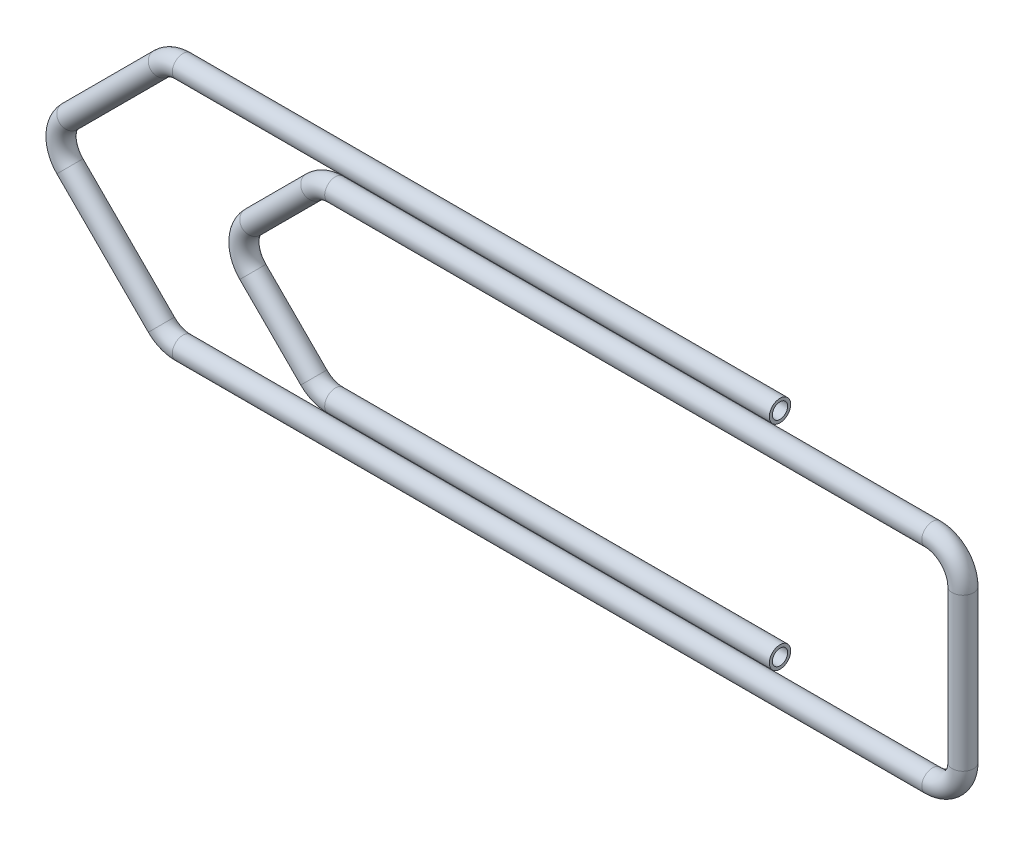
ISO-10303-21;
HEADER;
FILE_DESCRIPTION(('STEP AP214'),'2;1');
FILE_NAME('part.step','',(''),(''),'','','');
FILE_SCHEMA(('AUTOMOTIVE_DESIGN { 1 0 10303 214 1 1 1 1 }'));
ENDSEC;
DATA;
#1=APPLICATION_CONTEXT('core data for automotive mechanical design processes');
#2=APPLICATION_PROTOCOL_DEFINITION('international standard','automotive_design',2000,#1);
#3=PRODUCT_CONTEXT('',#1,'mechanical');
#4=PRODUCT('Part','Part','',(#3));
#5=PRODUCT_RELATED_PRODUCT_CATEGORY('part','',(#4));
#6=PRODUCT_DEFINITION_FORMATION('','',#4);
#7=PRODUCT_DEFINITION_CONTEXT('part definition',#1,'design');
#8=PRODUCT_DEFINITION('design','',#6,#7);
#9=PRODUCT_DEFINITION_SHAPE('','',#8);
#10=(LENGTH_UNIT() NAMED_UNIT(*) SI_UNIT(.MILLI.,.METRE.));
#11=(NAMED_UNIT(*) PLANE_ANGLE_UNIT() SI_UNIT($,.RADIAN.));
#12=(NAMED_UNIT(*) SI_UNIT($,.STERADIAN.) SOLID_ANGLE_UNIT());
#13=UNCERTAINTY_MEASURE_WITH_UNIT(LENGTH_MEASURE(1.E-05),#10,'distance_accuracy_value','');
#14=(GEOMETRIC_REPRESENTATION_CONTEXT(3) GLOBAL_UNCERTAINTY_ASSIGNED_CONTEXT((#13)) GLOBAL_UNIT_ASSIGNED_CONTEXT((#10,
#11,#12)) REPRESENTATION_CONTEXT('',''));
#15=CARTESIAN_POINT('',(0.,0.,0.));
#16=DIRECTION('',(0.,0.,1.));
#17=DIRECTION('',(1.,0.,0.));
#18=AXIS2_PLACEMENT_3D('',#15,#16,#17);
#19=CARTESIAN_POINT('',(0.,0.,0.));
#20=DIRECTION('',(1.,0.,0.));
#21=DIRECTION('',(0.,0.,-1.));
#22=AXIS2_PLACEMENT_3D('',#19,#20,#21);
#23=PLANE('',#22);
#24=CARTESIAN_POINT('',(0.,0.,0.));
#25=DIRECTION('',(1.,0.,0.));
#26=DIRECTION('',(0.,0.,-1.));
#27=AXIS2_PLACEMENT_3D('',#24,#25,#26);
#28=CIRCLE('',#27,0.25);
#29=CARTESIAN_POINT('',(0.,0.,-0.25));
#30=VERTEX_POINT('',#29);
#31=EDGE_CURVE('E205',#30,#30,#28,.T.);
#32=ORIENTED_EDGE('',*,*,#31,.F.);
#33=EDGE_LOOP('',(#32));
#34=FACE_BOUND('',#33,.T.);
#35=CARTESIAN_POINT('',(0.,0.,0.));
#36=DIRECTION('',(1.,0.,0.));
#37=DIRECTION('',(0.,0.,-1.));
#38=AXIS2_PLACEMENT_3D('',#35,#36,#37);
#39=CIRCLE('',#38,0.35);
#40=CARTESIAN_POINT('',(0.,0.,-0.35));
#41=VERTEX_POINT('',#40);
#42=EDGE_CURVE('E45',#41,#41,#39,.T.);
#43=ORIENTED_EDGE('',*,*,#42,.T.);
#44=EDGE_LOOP('',(#43));
#45=FACE_BOUND('',#44,.T.);
#46=ADVANCED_FACE('F33',(#34,#45),#23,.T.);
#47=CARTESIAN_POINT('',(0.,-7.,0.));
#48=DIRECTION('',(-1.,0.,0.));
#49=DIRECTION('',(0.,0.,-1.));
#50=AXIS2_PLACEMENT_3D('',#47,#48,#49);
#51=PLANE('',#50);
#52=CARTESIAN_POINT('',(0.,-7.,0.));
#53=DIRECTION('',(-1.,0.,0.));
#54=DIRECTION('',(0.,-1.,0.));
#55=AXIS2_PLACEMENT_3D('',#52,#53,#54);
#56=CIRCLE('',#55,0.25);
#57=CARTESIAN_POINT('',(0.,-7.25,0.));
#58=VERTEX_POINT('',#57);
#59=EDGE_CURVE('E252',#58,#58,#56,.T.);
#60=ORIENTED_EDGE('',*,*,#59,.T.);
#61=EDGE_LOOP('',(#60));
#62=FACE_BOUND('',#61,.T.);
#63=CARTESIAN_POINT('',(0.,-7.,0.));
#64=DIRECTION('',(-1.,0.,0.));
#65=DIRECTION('',(0.,0.,-1.));
#66=AXIS2_PLACEMENT_3D('',#63,#64,#65);
#67=CIRCLE('',#66,0.35);
#68=CARTESIAN_POINT('',(0.,-7.,-0.35));
#69=VERTEX_POINT('',#68);
#70=EDGE_CURVE('E11',#69,#69,#67,.T.);
#71=ORIENTED_EDGE('',*,*,#70,.F.);
#72=EDGE_LOOP('',(#71));
#73=FACE_BOUND('',#72,.T.);
#74=ADVANCED_FACE('F51',(#62,#73),#51,.F.);
#75=CARTESIAN_POINT('',(0.,0.,0.));
#76=DIRECTION('',(-1.,0.,0.));
#77=DIRECTION('',(0.,-1.,0.));
#78=AXIS2_PLACEMENT_3D('',#75,#76,#77);
#79=CYLINDRICAL_SURFACE('',#78,0.35);
#80=CARTESIAN_POINT('',(-19.5857864376269,0.,0.));
#81=DIRECTION('',(1.,0.,0.));
#82=DIRECTION('',(0.,0.,-1.));
#83=AXIS2_PLACEMENT_3D('',#80,#81,#82);
#84=CIRCLE('',#83,0.35);
#85=CARTESIAN_POINT('',(-19.5857864376269,0.349999999999998,0.));
#86=VERTEX_POINT('',#85);
#87=EDGE_CURVE('E256',#86,#86,#84,.T.);
#88=ORIENTED_EDGE('',*,*,#87,.T.);
#89=EDGE_LOOP('',(#88));
#90=FACE_BOUND('',#89,.T.);
#91=ORIENTED_EDGE('',*,*,#42,.F.);
#92=EDGE_LOOP('',(#91));
#93=FACE_BOUND('',#92,.T.);
#94=ADVANCED_FACE('F53',(#90,#93),#79,.T.);
#95=CARTESIAN_POINT('',(-19.5857864376269,-1.,0.));
#96=DIRECTION('',(0.,0.,1.));
#97=DIRECTION('',(1.,0.,0.));
#98=AXIS2_PLACEMENT_3D('',#95,#96,#97);
#99=TOROIDAL_SURFACE('',#98,0.999999999999998,0.35);
#100=CARTESIAN_POINT('',(-20.2928932188135,-0.292893218813453,0.));
#101=DIRECTION('',(0.707106781186549,0.707106781186546,0.));
#102=DIRECTION('',(0.,0.,-1.));
#103=AXIS2_PLACEMENT_3D('',#100,#101,#102);
#104=CIRCLE('',#103,0.35);
#105=CARTESIAN_POINT('',(-20.5403805922287,-0.0454058453981608,0.));
#106=VERTEX_POINT('',#105);
#107=EDGE_CURVE('E259',#106,#106,#104,.T.);
#108=CARTESIAN_POINT('',(-19.5857864376269,-1.,0.));
#109=DIRECTION('',(0.,0.,1.));
#110=DIRECTION('',(1.,0.,0.));
#111=AXIS2_PLACEMENT_3D('',#108,#109,#110);
#112=CIRCLE('',#111,1.35);
#113=EDGE_CURVE('',#86,#106,#112,.T.);
#114=ORIENTED_EDGE('',*,*,#87,.F.);
#115=ORIENTED_EDGE('',*,*,#107,.T.);
#116=ORIENTED_EDGE('',*,*,#113,.T.);
#117=ORIENTED_EDGE('',*,*,#113,.F.);
#118=EDGE_LOOP('',(#114,#116,#115,#117));
#119=FACE_BOUND('',#118,.T.);
#120=ADVANCED_FACE('F60',(#119),#99,.T.);
#121=CARTESIAN_POINT('',(-20.2928932188135,-0.292893218813453,0.));
#122=DIRECTION('',(-0.707106781186548,-0.707106781186547,0.));
#123=DIRECTION('',(0.707106781186547,-0.707106781186548,0.));
#124=AXIS2_PLACEMENT_3D('',#121,#122,#123);
#125=CYLINDRICAL_SURFACE('',#124,0.35);
#126=CARTESIAN_POINT('',(-23.2928932188134,-3.29289321881345,0.));
#127=DIRECTION('',(0.707106781186548,0.707106781186547,0.));
#128=DIRECTION('',(0.,0.,-1.));
#129=AXIS2_PLACEMENT_3D('',#126,#127,#128);
#130=CIRCLE('',#129,0.35);
#131=CARTESIAN_POINT('',(-23.5403805922287,-3.04540584539815,0.));
#132=VERTEX_POINT('',#131);
#133=EDGE_CURVE('E262',#132,#132,#130,.T.);
#134=ORIENTED_EDGE('',*,*,#133,.T.);
#135=EDGE_LOOP('',(#134));
#136=FACE_BOUND('',#135,.T.);
#137=ORIENTED_EDGE('',*,*,#107,.F.);
#138=EDGE_LOOP('',(#137));
#139=FACE_BOUND('',#138,.T.);
#140=ADVANCED_FACE('F127',(#136,#139),#125,.T.);
#141=CARTESIAN_POINT('',(-22.5857864376269,-4.,0.));
#142=DIRECTION('',(0.,0.,1.));
#143=DIRECTION('',(1.,0.,0.));
#144=AXIS2_PLACEMENT_3D('',#141,#142,#143);
#145=TOROIDAL_SURFACE('',#144,1.,0.35);
#146=CARTESIAN_POINT('',(-23.2928932188134,-4.70710678118655,0.));
#147=DIRECTION('',(-0.707106781186551,0.707106781186544,0.));
#148=DIRECTION('',(0.,0.,-1.));
#149=AXIS2_PLACEMENT_3D('',#146,#147,#148);
#150=CIRCLE('',#149,0.35);
#151=CARTESIAN_POINT('',(-23.5403805922287,-4.95459415460185,0.));
#152=VERTEX_POINT('',#151);
#153=EDGE_CURVE('E265',#152,#152,#150,.T.);
#154=CARTESIAN_POINT('',(-22.5857864376269,-4.,0.));
#155=DIRECTION('',(0.,0.,1.));
#156=DIRECTION('',(1.,0.,0.));
#157=AXIS2_PLACEMENT_3D('',#154,#155,#156);
#158=CIRCLE('',#157,1.35);
#159=EDGE_CURVE('',#132,#152,#158,.T.);
#160=ORIENTED_EDGE('',*,*,#133,.F.);
#161=ORIENTED_EDGE('',*,*,#153,.T.);
#162=ORIENTED_EDGE('',*,*,#159,.T.);
#163=ORIENTED_EDGE('',*,*,#159,.F.);
#164=EDGE_LOOP('',(#160,#162,#161,#163));
#165=FACE_BOUND('',#164,.T.);
#166=ADVANCED_FACE('F123',(#165),#145,.T.);
#167=CARTESIAN_POINT('',(-23.2928932188134,-4.70710678118655,0.));
#168=DIRECTION('',(0.707106781186547,-0.707106781186548,0.));
#169=DIRECTION('',(0.707106781186548,0.707106781186547,0.));
#170=AXIS2_PLACEMENT_3D('',#167,#168,#169);
#171=CYLINDRICAL_SURFACE('',#170,0.35);
#172=CARTESIAN_POINT('',(-20.2928932188135,-7.70710678118655,0.));
#173=DIRECTION('',(-0.707106781186547,0.707106781186548,0.));
#174=DIRECTION('',(0.,0.,-1.));
#175=AXIS2_PLACEMENT_3D('',#172,#173,#174);
#176=CIRCLE('',#175,0.35);
#177=CARTESIAN_POINT('',(-20.5403805922288,-7.95459415460184,0.));
#178=VERTEX_POINT('',#177);
#179=EDGE_CURVE('E268',#178,#178,#176,.T.);
#180=ORIENTED_EDGE('',*,*,#179,.T.);
#181=EDGE_LOOP('',(#180));
#182=FACE_BOUND('',#181,.T.);
#183=ORIENTED_EDGE('',*,*,#153,.F.);
#184=EDGE_LOOP('',(#183));
#185=FACE_BOUND('',#184,.T.);
#186=ADVANCED_FACE('F119',(#182,#185),#171,.T.);
#187=CARTESIAN_POINT('',(-19.5857864376269,-7.,0.));
#188=DIRECTION('',(0.,0.,1.));
#189=DIRECTION('',(1.,0.,0.));
#190=AXIS2_PLACEMENT_3D('',#187,#188,#189);
#191=TOROIDAL_SURFACE('',#190,0.999999999999999,0.35);
#192=CARTESIAN_POINT('',(-19.5857864376269,-8.,0.));
#193=DIRECTION('',(-1.,0.,0.));
#194=DIRECTION('',(0.,0.,-1.));
#195=AXIS2_PLACEMENT_3D('',#192,#193,#194);
#196=CIRCLE('',#195,0.35);
#197=CARTESIAN_POINT('',(-19.5857864376269,-8.35,0.));
#198=VERTEX_POINT('',#197);
#199=EDGE_CURVE('E271',#198,#198,#196,.T.);
#200=CARTESIAN_POINT('',(-19.5857864376269,-7.,0.));
#201=DIRECTION('',(0.,0.,1.));
#202=DIRECTION('',(1.,0.,0.));
#203=AXIS2_PLACEMENT_3D('',#200,#201,#202);
#204=CIRCLE('',#203,1.35);
#205=EDGE_CURVE('',#178,#198,#204,.T.);
#206=ORIENTED_EDGE('',*,*,#179,.F.);
#207=ORIENTED_EDGE('',*,*,#199,.T.);
#208=ORIENTED_EDGE('',*,*,#205,.T.);
#209=ORIENTED_EDGE('',*,*,#205,.F.);
#210=EDGE_LOOP('',(#206,#208,#207,#209));
#211=FACE_BOUND('',#210,.T.);
#212=ADVANCED_FACE('F115',(#211),#191,.T.);
#213=CARTESIAN_POINT('',(-19.5857864376269,-8.,0.));
#214=DIRECTION('',(1.,0.,0.));
#215=DIRECTION('',(0.,0.,-1.));
#216=AXIS2_PLACEMENT_3D('',#213,#214,#215);
#217=CYLINDRICAL_SURFACE('',#216,0.35);
#218=CARTESIAN_POINT('',(5.,-8.,0.));
#219=DIRECTION('',(-1.,0.,0.));
#220=DIRECTION('',(0.,0.,-1.));
#221=AXIS2_PLACEMENT_3D('',#218,#219,#220);
#222=CIRCLE('',#221,0.35);
#223=CARTESIAN_POINT('',(5.,-8.35,0.));
#224=VERTEX_POINT('',#223);
#225=EDGE_CURVE('E274',#224,#224,#222,.T.);
#226=ORIENTED_EDGE('',*,*,#225,.T.);
#227=EDGE_LOOP('',(#226));
#228=FACE_BOUND('',#227,.T.);
#229=ORIENTED_EDGE('',*,*,#199,.F.);
#230=EDGE_LOOP('',(#229));
#231=FACE_BOUND('',#230,.T.);
#232=ADVANCED_FACE('F111',(#228,#231),#217,.T.);
#233=CARTESIAN_POINT('',(5.,-7.,0.));
#234=DIRECTION('',(0.,0.,1.));
#235=DIRECTION('',(1.,0.,0.));
#236=AXIS2_PLACEMENT_3D('',#233,#234,#235);
#237=TOROIDAL_SURFACE('',#236,1.,0.35);
#238=CARTESIAN_POINT('',(6.,-7.,0.));
#239=DIRECTION('',(0.,-1.,0.));
#240=DIRECTION('',(0.,0.,-1.));
#241=AXIS2_PLACEMENT_3D('',#238,#239,#240);
#242=CIRCLE('',#241,0.35);
#243=CARTESIAN_POINT('',(6.35,-7.,0.));
#244=VERTEX_POINT('',#243);
#245=EDGE_CURVE('E277',#244,#244,#242,.T.);
#246=CARTESIAN_POINT('',(5.,-7.,0.));
#247=DIRECTION('',(0.,0.,1.));
#248=DIRECTION('',(1.,0.,0.));
#249=AXIS2_PLACEMENT_3D('',#246,#247,#248);
#250=CIRCLE('',#249,1.35);
#251=EDGE_CURVE('',#224,#244,#250,.T.);
#252=ORIENTED_EDGE('',*,*,#225,.F.);
#253=ORIENTED_EDGE('',*,*,#245,.T.);
#254=ORIENTED_EDGE('',*,*,#251,.T.);
#255=ORIENTED_EDGE('',*,*,#251,.F.);
#256=EDGE_LOOP('',(#252,#254,#253,#255));
#257=FACE_BOUND('',#256,.T.);
#258=ADVANCED_FACE('F107',(#257),#237,.T.);
#259=CARTESIAN_POINT('',(6.,-7.,0.));
#260=DIRECTION('',(0.,1.,0.));
#261=DIRECTION('',(0.,0.,1.));
#262=AXIS2_PLACEMENT_3D('',#259,#260,#261);
#263=CYLINDRICAL_SURFACE('',#262,0.35);
#264=CARTESIAN_POINT('',(6.,-2.,0.));
#265=DIRECTION('',(0.,-1.,0.));
#266=DIRECTION('',(0.,0.,-1.));
#267=AXIS2_PLACEMENT_3D('',#264,#265,#266);
#268=CIRCLE('',#267,0.35);
#269=CARTESIAN_POINT('',(6.35,-2.,0.));
#270=VERTEX_POINT('',#269);
#271=EDGE_CURVE('E280',#270,#270,#268,.T.);
#272=ORIENTED_EDGE('',*,*,#271,.T.);
#273=EDGE_LOOP('',(#272));
#274=FACE_BOUND('',#273,.T.);
#275=ORIENTED_EDGE('',*,*,#245,.F.);
#276=EDGE_LOOP('',(#275));
#277=FACE_BOUND('',#276,.T.);
#278=ADVANCED_FACE('F103',(#274,#277),#263,.T.);
#279=CARTESIAN_POINT('',(5.,-2.,0.));
#280=DIRECTION('',(0.,0.,1.));
#281=DIRECTION('',(1.,0.,0.));
#282=AXIS2_PLACEMENT_3D('',#279,#280,#281);
#283=TOROIDAL_SURFACE('',#282,1.,0.35);
#284=CARTESIAN_POINT('',(5.,-0.999999999999999,0.));
#285=DIRECTION('',(1.,0.,0.));
#286=DIRECTION('',(0.,0.,-1.));
#287=AXIS2_PLACEMENT_3D('',#284,#285,#286);
#288=CIRCLE('',#287,0.35);
#289=CARTESIAN_POINT('',(5.,-0.649999999999999,0.));
#290=VERTEX_POINT('',#289);
#291=EDGE_CURVE('E283',#290,#290,#288,.T.);
#292=CARTESIAN_POINT('',(5.,-2.,0.));
#293=DIRECTION('',(0.,0.,1.));
#294=DIRECTION('',(1.,0.,0.));
#295=AXIS2_PLACEMENT_3D('',#292,#293,#294);
#296=CIRCLE('',#295,1.35);
#297=EDGE_CURVE('',#270,#290,#296,.T.);
#298=ORIENTED_EDGE('',*,*,#271,.F.);
#299=ORIENTED_EDGE('',*,*,#291,.T.);
#300=ORIENTED_EDGE('',*,*,#297,.T.);
#301=ORIENTED_EDGE('',*,*,#297,.F.);
#302=EDGE_LOOP('',(#298,#300,#299,#301));
#303=FACE_BOUND('',#302,.T.);
#304=ADVANCED_FACE('F99',(#303),#283,.T.);
#305=CARTESIAN_POINT('',(5.,-0.999999999999999,0.));
#306=DIRECTION('',(-1.,0.,0.));
#307=DIRECTION('',(0.,-1.,0.));
#308=AXIS2_PLACEMENT_3D('',#305,#306,#307);
#309=CYLINDRICAL_SURFACE('',#308,0.35);
#310=CARTESIAN_POINT('',(-14.5857864376269,-1.,0.));
#311=DIRECTION('',(1.,0.,0.));
#312=DIRECTION('',(0.,0.,-1.));
#313=AXIS2_PLACEMENT_3D('',#310,#311,#312);
#314=CIRCLE('',#313,0.35);
#315=CARTESIAN_POINT('',(-14.5857864376269,-0.650000000000002,0.));
#316=VERTEX_POINT('',#315);
#317=EDGE_CURVE('E286',#316,#316,#314,.T.);
#318=ORIENTED_EDGE('',*,*,#317,.T.);
#319=EDGE_LOOP('',(#318));
#320=FACE_BOUND('',#319,.T.);
#321=ORIENTED_EDGE('',*,*,#291,.F.);
#322=EDGE_LOOP('',(#321));
#323=FACE_BOUND('',#322,.T.);
#324=ADVANCED_FACE('F95',(#320,#323),#309,.T.);
#325=CARTESIAN_POINT('',(-14.5857864376269,-2.,0.));
#326=DIRECTION('',(0.,0.,1.));
#327=DIRECTION('',(1.,0.,0.));
#328=AXIS2_PLACEMENT_3D('',#325,#326,#327);
#329=TOROIDAL_SURFACE('',#328,1.,0.35);
#330=CARTESIAN_POINT('',(-15.2928932188135,-1.29289321881345,0.));
#331=DIRECTION('',(0.707106781186548,0.707106781186547,0.));
#332=DIRECTION('',(0.,0.,-1.));
#333=AXIS2_PLACEMENT_3D('',#330,#331,#332);
#334=CIRCLE('',#333,0.35);
#335=CARTESIAN_POINT('',(-15.5403805922287,-1.04540584539816,0.));
#336=VERTEX_POINT('',#335);
#337=EDGE_CURVE('E289',#336,#336,#334,.T.);
#338=CARTESIAN_POINT('',(-14.5857864376269,-2.,0.));
#339=DIRECTION('',(0.,0.,1.));
#340=DIRECTION('',(1.,0.,0.));
#341=AXIS2_PLACEMENT_3D('',#338,#339,#340);
#342=CIRCLE('',#341,1.35);
#343=EDGE_CURVE('',#316,#336,#342,.T.);
#344=ORIENTED_EDGE('',*,*,#317,.F.);
#345=ORIENTED_EDGE('',*,*,#337,.T.);
#346=ORIENTED_EDGE('',*,*,#343,.T.);
#347=ORIENTED_EDGE('',*,*,#343,.F.);
#348=EDGE_LOOP('',(#344,#346,#345,#347));
#349=FACE_BOUND('',#348,.T.);
#350=ADVANCED_FACE('F91',(#349),#329,.T.);
#351=CARTESIAN_POINT('',(-15.2928932188135,-1.29289321881345,0.));
#352=DIRECTION('',(-0.707106781186548,-0.707106781186547,0.));
#353=DIRECTION('',(0.707106781186547,-0.707106781186548,0.));
#354=AXIS2_PLACEMENT_3D('',#351,#352,#353);
#355=CYLINDRICAL_SURFACE('',#354,0.35);
#356=CARTESIAN_POINT('',(-17.2928932188135,-3.29289321881345,0.));
#357=DIRECTION('',(0.707106781186548,0.707106781186547,0.));
#358=DIRECTION('',(0.,0.,-1.));
#359=AXIS2_PLACEMENT_3D('',#356,#357,#358);
#360=CIRCLE('',#359,0.35);
#361=CARTESIAN_POINT('',(-17.5403805922287,-3.04540584539816,0.));
#362=VERTEX_POINT('',#361);
#363=EDGE_CURVE('E292',#362,#362,#360,.T.);
#364=ORIENTED_EDGE('',*,*,#363,.T.);
#365=EDGE_LOOP('',(#364));
#366=FACE_BOUND('',#365,.T.);
#367=ORIENTED_EDGE('',*,*,#337,.F.);
#368=EDGE_LOOP('',(#367));
#369=FACE_BOUND('',#368,.T.);
#370=ADVANCED_FACE('F87',(#366,#369),#355,.T.);
#371=CARTESIAN_POINT('',(-16.5857864376269,-4.,0.));
#372=DIRECTION('',(0.,0.,1.));
#373=DIRECTION('',(1.,0.,0.));
#374=AXIS2_PLACEMENT_3D('',#371,#372,#373);
#375=TOROIDAL_SURFACE('',#374,1.,0.35);
#376=CARTESIAN_POINT('',(-17.2928932188135,-4.70710678118655,0.));
#377=DIRECTION('',(-0.707106781186547,0.707106781186548,0.));
#378=DIRECTION('',(0.,0.,-1.));
#379=AXIS2_PLACEMENT_3D('',#376,#377,#378);
#380=CIRCLE('',#379,0.35);
#381=CARTESIAN_POINT('',(-17.5403805922287,-4.95459415460184,0.));
#382=VERTEX_POINT('',#381);
#383=EDGE_CURVE('E295',#382,#382,#380,.T.);
#384=CARTESIAN_POINT('',(-16.5857864376269,-4.,0.));
#385=DIRECTION('',(0.,0.,1.));
#386=DIRECTION('',(1.,0.,0.));
#387=AXIS2_PLACEMENT_3D('',#384,#385,#386);
#388=CIRCLE('',#387,1.35);
#389=EDGE_CURVE('',#362,#382,#388,.T.);
#390=ORIENTED_EDGE('',*,*,#363,.F.);
#391=ORIENTED_EDGE('',*,*,#383,.T.);
#392=ORIENTED_EDGE('',*,*,#389,.T.);
#393=ORIENTED_EDGE('',*,*,#389,.F.);
#394=EDGE_LOOP('',(#390,#392,#391,#393));
#395=FACE_BOUND('',#394,.T.);
#396=ADVANCED_FACE('F83',(#395),#375,.T.);
#397=CARTESIAN_POINT('',(-17.2928932188135,-4.70710678118655,0.));
#398=DIRECTION('',(0.707106781186547,-0.707106781186548,0.));
#399=DIRECTION('',(0.707106781186548,0.707106781186547,0.));
#400=AXIS2_PLACEMENT_3D('',#397,#398,#399);
#401=CYLINDRICAL_SURFACE('',#400,0.35);
#402=CARTESIAN_POINT('',(-15.2928932188135,-6.70710678118656,0.));
#403=DIRECTION('',(-0.707106781186547,0.707106781186548,0.));
#404=DIRECTION('',(0.,0.,-1.));
#405=AXIS2_PLACEMENT_3D('',#402,#403,#404);
#406=CIRCLE('',#405,0.35);
#407=CARTESIAN_POINT('',(-15.5403805922287,-6.95459415460185,0.));
#408=VERTEX_POINT('',#407);
#409=EDGE_CURVE('E298',#408,#408,#406,.T.);
#410=ORIENTED_EDGE('',*,*,#409,.T.);
#411=EDGE_LOOP('',(#410));
#412=FACE_BOUND('',#411,.T.);
#413=ORIENTED_EDGE('',*,*,#383,.F.);
#414=EDGE_LOOP('',(#413));
#415=FACE_BOUND('',#414,.T.);
#416=ADVANCED_FACE('F77',(#412,#415),#401,.T.);
#417=CARTESIAN_POINT('',(-14.5857864376269,-6.,0.));
#418=DIRECTION('',(0.,0.,1.));
#419=DIRECTION('',(1.,0.,0.));
#420=AXIS2_PLACEMENT_3D('',#417,#418,#419);
#421=TOROIDAL_SURFACE('',#420,1.,0.35);
#422=CARTESIAN_POINT('',(-14.5857864376269,-7.00000000000001,0.));
#423=DIRECTION('',(-1.,0.,0.));
#424=DIRECTION('',(0.,0.,-1.));
#425=AXIS2_PLACEMENT_3D('',#422,#423,#424);
#426=CIRCLE('',#425,0.35);
#427=CARTESIAN_POINT('',(-14.5857864376269,-7.35000000000001,0.));
#428=VERTEX_POINT('',#427);
#429=EDGE_CURVE('E40',#428,#428,#426,.T.);
#430=CARTESIAN_POINT('',(-14.5857864376269,-6.,0.));
#431=DIRECTION('',(0.,0.,1.));
#432=DIRECTION('',(1.,0.,0.));
#433=AXIS2_PLACEMENT_3D('',#430,#431,#432);
#434=CIRCLE('',#433,1.35);
#435=EDGE_CURVE('',#408,#428,#434,.T.);
#436=ORIENTED_EDGE('',*,*,#409,.F.);
#437=ORIENTED_EDGE('',*,*,#429,.T.);
#438=ORIENTED_EDGE('',*,*,#435,.T.);
#439=ORIENTED_EDGE('',*,*,#435,.F.);
#440=EDGE_LOOP('',(#436,#438,#437,#439));
#441=FACE_BOUND('',#440,.T.);
#442=ADVANCED_FACE('F69',(#441),#421,.T.);
#443=CARTESIAN_POINT('',(-14.5857864376269,-7.00000000000001,0.));
#444=DIRECTION('',(1.,0.,0.));
#445=DIRECTION('',(0.,1.,0.));
#446=AXIS2_PLACEMENT_3D('',#443,#444,#445);
#447=CYLINDRICAL_SURFACE('',#446,0.35);
#448=ORIENTED_EDGE('',*,*,#70,.T.);
#449=EDGE_LOOP('',(#448));
#450=FACE_BOUND('',#449,.T.);
#451=ORIENTED_EDGE('',*,*,#429,.F.);
#452=EDGE_LOOP('',(#451));
#453=FACE_BOUND('',#452,.T.);
#454=ADVANCED_FACE('F48',(#450,#453),#447,.T.);
#455=CARTESIAN_POINT('',(0.,0.,0.));
#456=DIRECTION('',(-1.,0.,0.));
#457=DIRECTION('',(0.,-1.,0.));
#458=AXIS2_PLACEMENT_3D('',#455,#456,#457);
#459=CYLINDRICAL_SURFACE('',#458,0.25);
#460=CARTESIAN_POINT('',(-19.5857864376269,0.,0.));
#461=DIRECTION('',(-1.,0.,0.));
#462=DIRECTION('',(0.,-1.,0.));
#463=AXIS2_PLACEMENT_3D('',#460,#461,#462);
#464=CIRCLE('',#463,0.25);
#465=CARTESIAN_POINT('',(-19.5857864376269,0.249999999999998,0.));
#466=VERTEX_POINT('',#465);
#467=EDGE_CURVE('E204',#466,#466,#464,.F.);
#468=ORIENTED_EDGE('',*,*,#467,.F.);
#469=EDGE_LOOP('',(#468));
#470=FACE_BOUND('',#469,.T.);
#471=ORIENTED_EDGE('',*,*,#31,.T.);
#472=EDGE_LOOP('',(#471));
#473=FACE_BOUND('',#472,.T.);
#474=ADVANCED_FACE('F68',(#470,#473),#459,.F.);
#475=CARTESIAN_POINT('',(-19.5857864376269,-1.,0.));
#476=DIRECTION('',(0.,0.,1.));
#477=DIRECTION('',(1.,0.,0.));
#478=AXIS2_PLACEMENT_3D('',#475,#476,#477);
#479=TOROIDAL_SURFACE('',#478,0.999999999999998,0.25);
#480=CARTESIAN_POINT('',(-20.2928932188135,-0.292893218813453,0.));
#481=DIRECTION('',(0.707106781186549,0.707106781186546,0.));
#482=DIRECTION('',(-0.707106781186546,0.707106781186549,0.));
#483=AXIS2_PLACEMENT_3D('',#480,#481,#482);
#484=CIRCLE('',#483,0.25);
#485=CARTESIAN_POINT('',(-20.4696699141101,-0.116116523516816,0.));
#486=VERTEX_POINT('',#485);
#487=EDGE_CURVE('E201',#486,#486,#484,.T.);
#488=CARTESIAN_POINT('',(-19.5857864376269,-1.,0.));
#489=DIRECTION('',(0.,0.,1.));
#490=DIRECTION('',(1.,0.,0.));
#491=AXIS2_PLACEMENT_3D('',#488,#489,#490);
#492=CIRCLE('',#491,1.25);
#493=EDGE_CURVE('',#466,#486,#492,.T.);
#494=ORIENTED_EDGE('',*,*,#467,.T.);
#495=ORIENTED_EDGE('',*,*,#487,.F.);
#496=ORIENTED_EDGE('',*,*,#493,.T.);
#497=ORIENTED_EDGE('',*,*,#493,.F.);
#498=EDGE_LOOP('',(#494,#496,#495,#497));
#499=FACE_BOUND('',#498,.T.);
#500=ADVANCED_FACE('F74',(#499),#479,.F.);
#501=CARTESIAN_POINT('',(-20.2928932188135,-0.292893218813453,0.));
#502=DIRECTION('',(-0.707106781186548,-0.707106781186547,0.));
#503=DIRECTION('',(0.707106781186547,-0.707106781186548,0.));
#504=AXIS2_PLACEMENT_3D('',#501,#502,#503);
#505=CYLINDRICAL_SURFACE('',#504,0.25);
#506=CARTESIAN_POINT('',(-23.2928932188134,-3.29289321881345,0.));
#507=DIRECTION('',(-0.707106781186548,-0.707106781186547,0.));
#508=DIRECTION('',(0.707106781186547,-0.707106781186548,0.));
#509=AXIS2_PLACEMENT_3D('',#506,#507,#508);
#510=CIRCLE('',#509,0.25);
#511=CARTESIAN_POINT('',(-23.4696699141101,-3.11611652351681,0.));
#512=VERTEX_POINT('',#511);
#513=EDGE_CURVE('E207',#512,#512,#510,.F.);
#514=ORIENTED_EDGE('',*,*,#513,.F.);
#515=EDGE_LOOP('',(#514));
#516=FACE_BOUND('',#515,.T.);
#517=ORIENTED_EDGE('',*,*,#487,.T.);
#518=EDGE_LOOP('',(#517));
#519=FACE_BOUND('',#518,.T.);
#520=ADVANCED_FACE('F189',(#516,#519),#505,.F.);
#521=CARTESIAN_POINT('',(-22.5857864376269,-4.,0.));
#522=DIRECTION('',(0.,0.,1.));
#523=DIRECTION('',(1.,0.,0.));
#524=AXIS2_PLACEMENT_3D('',#521,#522,#523);
#525=TOROIDAL_SURFACE('',#524,1.,0.25);
#526=CARTESIAN_POINT('',(-23.2928932188134,-4.70710678118655,0.));
#527=DIRECTION('',(-0.707106781186551,0.707106781186544,0.));
#528=DIRECTION('',(-0.707106781186544,-0.707106781186551,0.));
#529=AXIS2_PLACEMENT_3D('',#526,#527,#528);
#530=CIRCLE('',#529,0.25);
#531=CARTESIAN_POINT('',(-23.4696699141101,-4.88388347648319,0.));
#532=VERTEX_POINT('',#531);
#533=EDGE_CURVE('E214',#532,#532,#530,.T.);
#534=CARTESIAN_POINT('',(-22.5857864376269,-4.,0.));
#535=DIRECTION('',(0.,0.,1.));
#536=DIRECTION('',(1.,0.,0.));
#537=AXIS2_PLACEMENT_3D('',#534,#535,#536);
#538=CIRCLE('',#537,1.25);
#539=EDGE_CURVE('',#512,#532,#538,.T.);
#540=ORIENTED_EDGE('',*,*,#513,.T.);
#541=ORIENTED_EDGE('',*,*,#533,.F.);
#542=ORIENTED_EDGE('',*,*,#539,.T.);
#543=ORIENTED_EDGE('',*,*,#539,.F.);
#544=EDGE_LOOP('',(#540,#542,#541,#543));
#545=FACE_BOUND('',#544,.T.);
#546=ADVANCED_FACE('F185',(#545),#525,.F.);
#547=CARTESIAN_POINT('',(-23.2928932188134,-4.70710678118655,0.));
#548=DIRECTION('',(0.707106781186547,-0.707106781186548,0.));
#549=DIRECTION('',(0.707106781186548,0.707106781186547,0.));
#550=AXIS2_PLACEMENT_3D('',#547,#548,#549);
#551=CYLINDRICAL_SURFACE('',#550,0.25);
#552=CARTESIAN_POINT('',(-20.2928932188135,-7.70710678118655,0.));
#553=DIRECTION('',(0.707106781186547,-0.707106781186548,0.));
#554=DIRECTION('',(0.707106781186548,0.707106781186547,0.));
#555=AXIS2_PLACEMENT_3D('',#552,#553,#554);
#556=CIRCLE('',#555,0.25);
#557=CARTESIAN_POINT('',(-20.4696699141101,-7.88388347648318,0.));
#558=VERTEX_POINT('',#557);
#559=EDGE_CURVE('E217',#558,#558,#556,.F.);
#560=ORIENTED_EDGE('',*,*,#559,.F.);
#561=EDGE_LOOP('',(#560));
#562=FACE_BOUND('',#561,.T.);
#563=ORIENTED_EDGE('',*,*,#533,.T.);
#564=EDGE_LOOP('',(#563));
#565=FACE_BOUND('',#564,.T.);
#566=ADVANCED_FACE('F181',(#562,#565),#551,.F.);
#567=CARTESIAN_POINT('',(-19.5857864376269,-7.,0.));
#568=DIRECTION('',(0.,0.,1.));
#569=DIRECTION('',(1.,0.,0.));
#570=AXIS2_PLACEMENT_3D('',#567,#568,#569);
#571=TOROIDAL_SURFACE('',#570,0.999999999999999,0.25);
#572=CARTESIAN_POINT('',(-19.5857864376269,-8.,0.));
#573=DIRECTION('',(-1.,0.,0.));
#574=DIRECTION('',(0.,-1.,0.));
#575=AXIS2_PLACEMENT_3D('',#572,#573,#574);
#576=CIRCLE('',#575,0.25);
#577=CARTESIAN_POINT('',(-19.5857864376269,-8.25,0.));
#578=VERTEX_POINT('',#577);
#579=EDGE_CURVE('E220',#578,#578,#576,.T.);
#580=CARTESIAN_POINT('',(-19.5857864376269,-7.,0.));
#581=DIRECTION('',(0.,0.,1.));
#582=DIRECTION('',(1.,0.,0.));
#583=AXIS2_PLACEMENT_3D('',#580,#581,#582);
#584=CIRCLE('',#583,1.25);
#585=EDGE_CURVE('',#558,#578,#584,.T.);
#586=ORIENTED_EDGE('',*,*,#559,.T.);
#587=ORIENTED_EDGE('',*,*,#579,.F.);
#588=ORIENTED_EDGE('',*,*,#585,.T.);
#589=ORIENTED_EDGE('',*,*,#585,.F.);
#590=EDGE_LOOP('',(#586,#588,#587,#589));
#591=FACE_BOUND('',#590,.T.);
#592=ADVANCED_FACE('F177',(#591),#571,.F.);
#593=CARTESIAN_POINT('',(-19.5857864376269,-8.,0.));
#594=DIRECTION('',(1.,0.,0.));
#595=DIRECTION('',(0.,0.,-1.));
#596=AXIS2_PLACEMENT_3D('',#593,#594,#595);
#597=CYLINDRICAL_SURFACE('',#596,0.25);
#598=CARTESIAN_POINT('',(5.,-8.,0.));
#599=DIRECTION('',(1.,0.,0.));
#600=DIRECTION('',(0.,0.,-1.));
#601=AXIS2_PLACEMENT_3D('',#598,#599,#600);
#602=CIRCLE('',#601,0.25);
#603=CARTESIAN_POINT('',(5.,-8.25,0.));
#604=VERTEX_POINT('',#603);
#605=EDGE_CURVE('E223',#604,#604,#602,.F.);
#606=ORIENTED_EDGE('',*,*,#605,.F.);
#607=EDGE_LOOP('',(#606));
#608=FACE_BOUND('',#607,.T.);
#609=ORIENTED_EDGE('',*,*,#579,.T.);
#610=EDGE_LOOP('',(#609));
#611=FACE_BOUND('',#610,.T.);
#612=ADVANCED_FACE('F173',(#608,#611),#597,.F.);
#613=CARTESIAN_POINT('',(5.,-7.,0.));
#614=DIRECTION('',(0.,0.,1.));
#615=DIRECTION('',(1.,0.,0.));
#616=AXIS2_PLACEMENT_3D('',#613,#614,#615);
#617=TOROIDAL_SURFACE('',#616,1.,0.25);
#618=CARTESIAN_POINT('',(6.,-7.,0.));
#619=DIRECTION('',(0.,-1.,0.));
#620=DIRECTION('',(0.,0.,-1.));
#621=AXIS2_PLACEMENT_3D('',#618,#619,#620);
#622=CIRCLE('',#621,0.25);
#623=CARTESIAN_POINT('',(6.25,-7.,0.));
#624=VERTEX_POINT('',#623);
#625=EDGE_CURVE('E226',#624,#624,#622,.T.);
#626=CARTESIAN_POINT('',(5.,-7.,0.));
#627=DIRECTION('',(0.,0.,1.));
#628=DIRECTION('',(1.,0.,0.));
#629=AXIS2_PLACEMENT_3D('',#626,#627,#628);
#630=CIRCLE('',#629,1.25);
#631=EDGE_CURVE('',#604,#624,#630,.T.);
#632=ORIENTED_EDGE('',*,*,#605,.T.);
#633=ORIENTED_EDGE('',*,*,#625,.F.);
#634=ORIENTED_EDGE('',*,*,#631,.T.);
#635=ORIENTED_EDGE('',*,*,#631,.F.);
#636=EDGE_LOOP('',(#632,#634,#633,#635));
#637=FACE_BOUND('',#636,.T.);
#638=ADVANCED_FACE('F169',(#637),#617,.F.);
#639=CARTESIAN_POINT('',(6.,-7.,0.));
#640=DIRECTION('',(0.,1.,0.));
#641=DIRECTION('',(0.,0.,1.));
#642=AXIS2_PLACEMENT_3D('',#639,#640,#641);
#643=CYLINDRICAL_SURFACE('',#642,0.25);
#644=CARTESIAN_POINT('',(6.,-2.,0.));
#645=DIRECTION('',(0.,1.,0.));
#646=DIRECTION('',(0.,0.,1.));
#647=AXIS2_PLACEMENT_3D('',#644,#645,#646);
#648=CIRCLE('',#647,0.25);
#649=CARTESIAN_POINT('',(6.25,-2.,0.));
#650=VERTEX_POINT('',#649);
#651=EDGE_CURVE('E229',#650,#650,#648,.F.);
#652=ORIENTED_EDGE('',*,*,#651,.F.);
#653=EDGE_LOOP('',(#652));
#654=FACE_BOUND('',#653,.T.);
#655=ORIENTED_EDGE('',*,*,#625,.T.);
#656=EDGE_LOOP('',(#655));
#657=FACE_BOUND('',#656,.T.);
#658=ADVANCED_FACE('F165',(#654,#657),#643,.F.);
#659=CARTESIAN_POINT('',(5.,-2.,0.));
#660=DIRECTION('',(0.,0.,1.));
#661=DIRECTION('',(1.,0.,0.));
#662=AXIS2_PLACEMENT_3D('',#659,#660,#661);
#663=TOROIDAL_SURFACE('',#662,1.,0.25);
#664=CARTESIAN_POINT('',(5.,-0.999999999999999,0.));
#665=DIRECTION('',(1.,0.,0.));
#666=DIRECTION('',(0.,1.,0.));
#667=AXIS2_PLACEMENT_3D('',#664,#665,#666);
#668=CIRCLE('',#667,0.25);
#669=CARTESIAN_POINT('',(5.,-0.749999999999999,0.));
#670=VERTEX_POINT('',#669);
#671=EDGE_CURVE('E232',#670,#670,#668,.T.);
#672=CARTESIAN_POINT('',(5.,-2.,0.));
#673=DIRECTION('',(0.,0.,1.));
#674=DIRECTION('',(1.,0.,0.));
#675=AXIS2_PLACEMENT_3D('',#672,#673,#674);
#676=CIRCLE('',#675,1.25);
#677=EDGE_CURVE('',#650,#670,#676,.T.);
#678=ORIENTED_EDGE('',*,*,#651,.T.);
#679=ORIENTED_EDGE('',*,*,#671,.F.);
#680=ORIENTED_EDGE('',*,*,#677,.T.);
#681=ORIENTED_EDGE('',*,*,#677,.F.);
#682=EDGE_LOOP('',(#678,#680,#679,#681));
#683=FACE_BOUND('',#682,.T.);
#684=ADVANCED_FACE('F161',(#683),#663,.F.);
#685=CARTESIAN_POINT('',(5.,-0.999999999999999,0.));
#686=DIRECTION('',(-1.,0.,0.));
#687=DIRECTION('',(0.,-1.,0.));
#688=AXIS2_PLACEMENT_3D('',#685,#686,#687);
#689=CYLINDRICAL_SURFACE('',#688,0.25);
#690=CARTESIAN_POINT('',(-14.5857864376269,-1.,0.));
#691=DIRECTION('',(-1.,0.,0.));
#692=DIRECTION('',(0.,-1.,0.));
#693=AXIS2_PLACEMENT_3D('',#690,#691,#692);
#694=CIRCLE('',#693,0.25);
#695=CARTESIAN_POINT('',(-14.5857864376269,-0.750000000000002,0.));
#696=VERTEX_POINT('',#695);
#697=EDGE_CURVE('E235',#696,#696,#694,.F.);
#698=ORIENTED_EDGE('',*,*,#697,.F.);
#699=EDGE_LOOP('',(#698));
#700=FACE_BOUND('',#699,.T.);
#701=ORIENTED_EDGE('',*,*,#671,.T.);
#702=EDGE_LOOP('',(#701));
#703=FACE_BOUND('',#702,.T.);
#704=ADVANCED_FACE('F157',(#700,#703),#689,.F.);
#705=CARTESIAN_POINT('',(-14.5857864376269,-2.,0.));
#706=DIRECTION('',(0.,0.,1.));
#707=DIRECTION('',(1.,0.,0.));
#708=AXIS2_PLACEMENT_3D('',#705,#706,#707);
#709=TOROIDAL_SURFACE('',#708,1.,0.25);
#710=CARTESIAN_POINT('',(-15.2928932188135,-1.29289321881345,0.));
#711=DIRECTION('',(0.707106781186548,0.707106781186547,0.));
#712=DIRECTION('',(-0.707106781186547,0.707106781186548,0.));
#713=AXIS2_PLACEMENT_3D('',#710,#711,#712);
#714=CIRCLE('',#713,0.25);
#715=CARTESIAN_POINT('',(-15.4696699141101,-1.11611652351682,0.));
#716=VERTEX_POINT('',#715);
#717=EDGE_CURVE('E238',#716,#716,#714,.T.);
#718=CARTESIAN_POINT('',(-14.5857864376269,-2.,0.));
#719=DIRECTION('',(0.,0.,1.));
#720=DIRECTION('',(1.,0.,0.));
#721=AXIS2_PLACEMENT_3D('',#718,#719,#720);
#722=CIRCLE('',#721,1.25);
#723=EDGE_CURVE('',#696,#716,#722,.T.);
#724=ORIENTED_EDGE('',*,*,#697,.T.);
#725=ORIENTED_EDGE('',*,*,#717,.F.);
#726=ORIENTED_EDGE('',*,*,#723,.T.);
#727=ORIENTED_EDGE('',*,*,#723,.F.);
#728=EDGE_LOOP('',(#724,#726,#725,#727));
#729=FACE_BOUND('',#728,.T.);
#730=ADVANCED_FACE('F153',(#729),#709,.F.);
#731=CARTESIAN_POINT('',(-15.2928932188135,-1.29289321881345,0.));
#732=DIRECTION('',(-0.707106781186548,-0.707106781186547,0.));
#733=DIRECTION('',(0.707106781186547,-0.707106781186548,0.));
#734=AXIS2_PLACEMENT_3D('',#731,#732,#733);
#735=CYLINDRICAL_SURFACE('',#734,0.25);
#736=CARTESIAN_POINT('',(-17.2928932188135,-3.29289321881345,0.));
#737=DIRECTION('',(-0.707106781186548,-0.707106781186547,0.));
#738=DIRECTION('',(0.707106781186547,-0.707106781186548,0.));
#739=AXIS2_PLACEMENT_3D('',#736,#737,#738);
#740=CIRCLE('',#739,0.25);
#741=CARTESIAN_POINT('',(-17.4696699141101,-3.11611652351682,0.));
#742=VERTEX_POINT('',#741);
#743=EDGE_CURVE('E241',#742,#742,#740,.F.);
#744=ORIENTED_EDGE('',*,*,#743,.F.);
#745=EDGE_LOOP('',(#744));
#746=FACE_BOUND('',#745,.T.);
#747=ORIENTED_EDGE('',*,*,#717,.T.);
#748=EDGE_LOOP('',(#747));
#749=FACE_BOUND('',#748,.T.);
#750=ADVANCED_FACE('F149',(#746,#749),#735,.F.);
#751=CARTESIAN_POINT('',(-16.5857864376269,-4.,0.));
#752=DIRECTION('',(0.,0.,1.));
#753=DIRECTION('',(1.,0.,0.));
#754=AXIS2_PLACEMENT_3D('',#751,#752,#753);
#755=TOROIDAL_SURFACE('',#754,1.,0.25);
#756=CARTESIAN_POINT('',(-17.2928932188135,-4.70710678118655,0.));
#757=DIRECTION('',(-0.707106781186547,0.707106781186548,0.));
#758=DIRECTION('',(-0.707106781186548,-0.707106781186547,0.));
#759=AXIS2_PLACEMENT_3D('',#756,#757,#758);
#760=CIRCLE('',#759,0.25);
#761=CARTESIAN_POINT('',(-17.4696699141101,-4.88388347648319,0.));
#762=VERTEX_POINT('',#761);
#763=EDGE_CURVE('E244',#762,#762,#760,.T.);
#764=CARTESIAN_POINT('',(-16.5857864376269,-4.,0.));
#765=DIRECTION('',(0.,0.,1.));
#766=DIRECTION('',(1.,0.,0.));
#767=AXIS2_PLACEMENT_3D('',#764,#765,#766);
#768=CIRCLE('',#767,1.25);
#769=EDGE_CURVE('',#742,#762,#768,.T.);
#770=ORIENTED_EDGE('',*,*,#743,.T.);
#771=ORIENTED_EDGE('',*,*,#763,.F.);
#772=ORIENTED_EDGE('',*,*,#769,.T.);
#773=ORIENTED_EDGE('',*,*,#769,.F.);
#774=EDGE_LOOP('',(#770,#772,#771,#773));
#775=FACE_BOUND('',#774,.T.);
#776=ADVANCED_FACE('F145',(#775),#755,.F.);
#777=CARTESIAN_POINT('',(-17.2928932188135,-4.70710678118655,0.));
#778=DIRECTION('',(0.707106781186547,-0.707106781186548,0.));
#779=DIRECTION('',(0.707106781186548,0.707106781186547,0.));
#780=AXIS2_PLACEMENT_3D('',#777,#778,#779);
#781=CYLINDRICAL_SURFACE('',#780,0.25);
#782=CARTESIAN_POINT('',(-15.2928932188135,-6.70710678118655,0.));
#783=DIRECTION('',(0.707106781186547,-0.707106781186548,0.));
#784=DIRECTION('',(0.707106781186548,0.707106781186547,0.));
#785=AXIS2_PLACEMENT_3D('',#782,#783,#784);
#786=CIRCLE('',#785,0.25);
#787=CARTESIAN_POINT('',(-15.4696699141101,-6.88388347648319,0.));
#788=VERTEX_POINT('',#787);
#789=EDGE_CURVE('E247',#788,#788,#786,.F.);
#790=ORIENTED_EDGE('',*,*,#789,.F.);
#791=EDGE_LOOP('',(#790));
#792=FACE_BOUND('',#791,.T.);
#793=ORIENTED_EDGE('',*,*,#763,.T.);
#794=EDGE_LOOP('',(#793));
#795=FACE_BOUND('',#794,.T.);
#796=ADVANCED_FACE('F141',(#792,#795),#781,.F.);
#797=CARTESIAN_POINT('',(-14.5857864376269,-6.,0.));
#798=DIRECTION('',(0.,0.,1.));
#799=DIRECTION('',(1.,0.,0.));
#800=AXIS2_PLACEMENT_3D('',#797,#798,#799);
#801=TOROIDAL_SURFACE('',#800,1.,0.25);
#802=CARTESIAN_POINT('',(-14.5857864376269,-7.00000000000001,0.));
#803=DIRECTION('',(-1.,0.,0.));
#804=DIRECTION('',(0.,-1.,0.));
#805=AXIS2_PLACEMENT_3D('',#802,#803,#804);
#806=CIRCLE('',#805,0.25);
#807=CARTESIAN_POINT('',(-14.5857864376269,-7.25000000000001,0.));
#808=VERTEX_POINT('',#807);
#809=EDGE_CURVE('E250',#808,#808,#806,.T.);
#810=CARTESIAN_POINT('',(-14.5857864376269,-6.,0.));
#811=DIRECTION('',(0.,0.,1.));
#812=DIRECTION('',(1.,0.,0.));
#813=AXIS2_PLACEMENT_3D('',#810,#811,#812);
#814=CIRCLE('',#813,1.25);
#815=EDGE_CURVE('',#788,#808,#814,.T.);
#816=ORIENTED_EDGE('',*,*,#789,.T.);
#817=ORIENTED_EDGE('',*,*,#809,.F.);
#818=ORIENTED_EDGE('',*,*,#815,.T.);
#819=ORIENTED_EDGE('',*,*,#815,.F.);
#820=EDGE_LOOP('',(#816,#818,#817,#819));
#821=FACE_BOUND('',#820,.T.);
#822=ADVANCED_FACE('F137',(#821),#801,.F.);
#823=CARTESIAN_POINT('',(-14.5857864376269,-7.00000000000001,0.));
#824=DIRECTION('',(1.,0.,0.));
#825=DIRECTION('',(0.,1.,0.));
#826=AXIS2_PLACEMENT_3D('',#823,#824,#825);
#827=CYLINDRICAL_SURFACE('',#826,0.25);
#828=ORIENTED_EDGE('',*,*,#59,.F.);
#829=EDGE_LOOP('',(#828));
#830=FACE_BOUND('',#829,.T.);
#831=ORIENTED_EDGE('',*,*,#809,.T.);
#832=EDGE_LOOP('',(#831));
#833=FACE_BOUND('',#832,.T.);
#834=ADVANCED_FACE('F64',(#830,#833),#827,.F.);
#835=CLOSED_SHELL('',(#46,#74,#94,#120,#140,#166,#186,#212,#232,#258,#278,#304,#324,#350,#370,
#396,#416,#442,#454,#474,#500,#520,#546,#566,#592,#612,#638,#658,#684,#704,#730,#750,#776,#796,
#822,#834));
#836=MANIFOLD_SOLID_BREP('B2',#835);
#837=ADVANCED_BREP_SHAPE_REPRESENTATION('',(#18,#836),#14);
#838=SHAPE_DEFINITION_REPRESENTATION(#9,#837);
ENDSEC;
END-ISO-10303-21;
